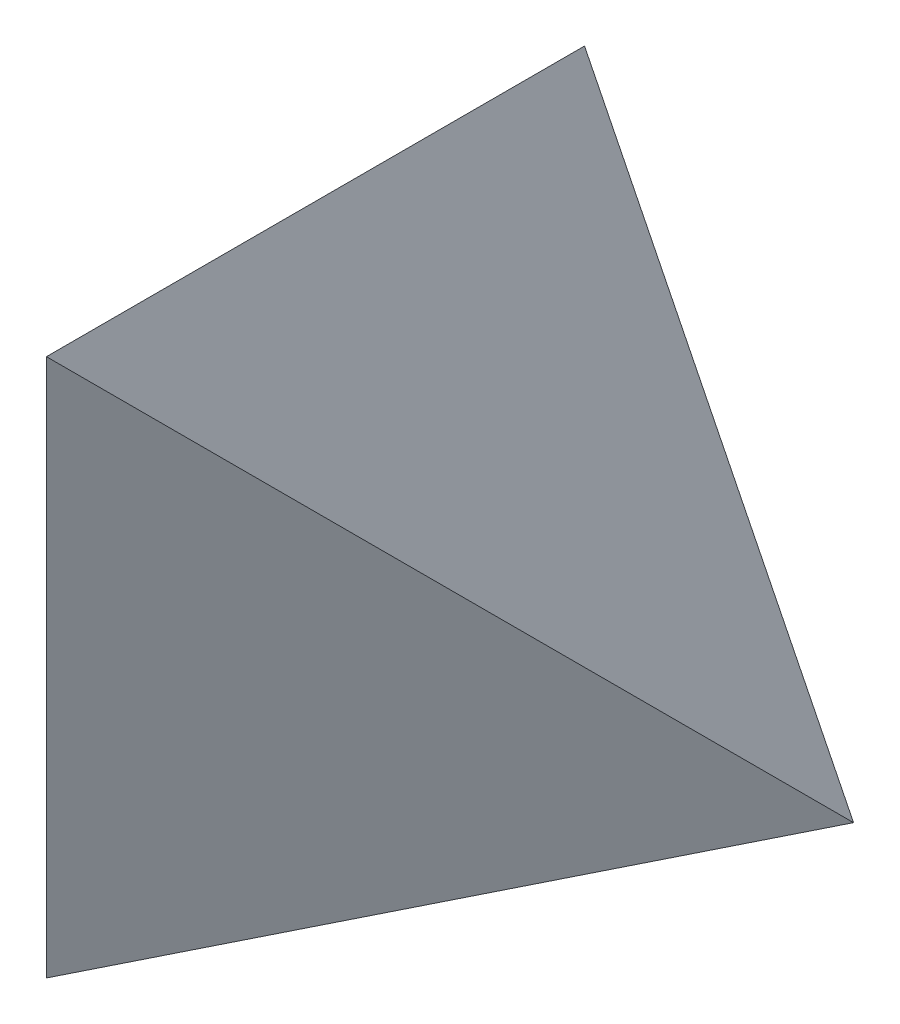
ISO-10303-21;
HEADER;
FILE_DESCRIPTION(('STEP AP214'),'2;1');
FILE_NAME('part.step','',(''),(''),'','','');
FILE_SCHEMA(('AUTOMOTIVE_DESIGN { 1 0 10303 214 1 1 1 1 }'));
ENDSEC;
DATA;
#1=APPLICATION_CONTEXT('core data for automotive mechanical design processes');
#2=APPLICATION_PROTOCOL_DEFINITION('international standard','automotive_design',2000,#1);
#3=PRODUCT_CONTEXT('',#1,'mechanical');
#4=PRODUCT('Part','Part','',(#3));
#5=PRODUCT_RELATED_PRODUCT_CATEGORY('part','',(#4));
#6=PRODUCT_DEFINITION_FORMATION('','',#4);
#7=PRODUCT_DEFINITION_CONTEXT('part definition',#1,'design');
#8=PRODUCT_DEFINITION('design','',#6,#7);
#9=PRODUCT_DEFINITION_SHAPE('','',#8);
#10=(LENGTH_UNIT() NAMED_UNIT(*) SI_UNIT(.MILLI.,.METRE.));
#11=(NAMED_UNIT(*) PLANE_ANGLE_UNIT() SI_UNIT($,.RADIAN.));
#12=(NAMED_UNIT(*) SI_UNIT($,.STERADIAN.) SOLID_ANGLE_UNIT());
#13=UNCERTAINTY_MEASURE_WITH_UNIT(LENGTH_MEASURE(1.E-05),#10,'distance_accuracy_value','');
#14=(GEOMETRIC_REPRESENTATION_CONTEXT(3) GLOBAL_UNCERTAINTY_ASSIGNED_CONTEXT((#13)) GLOBAL_UNIT_ASSIGNED_CONTEXT((#10,
#11,#12)) REPRESENTATION_CONTEXT('',''));
#15=CARTESIAN_POINT('',(0.,0.,0.));
#16=DIRECTION('',(0.,0.,1.));
#17=DIRECTION('',(1.,0.,0.));
#18=AXIS2_PLACEMENT_3D('',#15,#16,#17);
#19=CARTESIAN_POINT('',(40.,0.,40.));
#20=DIRECTION('',(0.,1.,0.));
#21=DIRECTION('',(0.,0.,1.));
#22=AXIS2_PLACEMENT_3D('',#19,#20,#21);
#23=PLANE('',#22);
#24=DIRECTION('',(1.,0.,0.));
#25=VECTOR('',#24,1.);
#26=CARTESIAN_POINT('',(40.,0.,0.));
#27=LINE('',#26,#25);
#28=CARTESIAN_POINT('',(0.,0.,0.));
#29=VERTEX_POINT('',#28);
#30=CARTESIAN_POINT('',(40.,0.,0.));
#31=VERTEX_POINT('',#30);
#32=EDGE_CURVE('E95',#29,#31,#27,.T.);
#33=ORIENTED_EDGE('',*,*,#32,.T.);
#34=DIRECTION('',(0.447213595499958,0.,-0.894427190999916));
#35=VECTOR('',#34,1.);
#36=CARTESIAN_POINT('',(32.,0.,16.));
#37=LINE('',#36,#35);
#38=CARTESIAN_POINT('',(20.,0.,40.));
#39=VERTEX_POINT('',#38);
#40=EDGE_CURVE('E83',#39,#31,#37,.T.);
#41=ORIENTED_EDGE('',*,*,#40,.F.);
#42=DIRECTION('',(0.447213595499958,0.,0.894427190999916));
#43=VECTOR('',#42,1.);
#44=CARTESIAN_POINT('',(0.,0.,0.));
#45=LINE('',#44,#43);
#46=EDGE_CURVE('E88',#29,#39,#45,.T.);
#47=ORIENTED_EDGE('',*,*,#46,.F.);
#48=EDGE_LOOP('',(#33,#41,#47));
#49=FACE_BOUND('',#48,.T.);
#50=ADVANCED_FACE('F52',(#49),#23,.F.);
#51=CARTESIAN_POINT('',(20.,40.,40.));
#52=DIRECTION('',(-0.894427190999916,-0.447213595499958,0.));
#53=DIRECTION('',(0.447213595499958,-0.894427190999916,0.));
#54=AXIS2_PLACEMENT_3D('',#51,#52,#53);
#55=PLANE('',#54);
#56=DIRECTION('',(0.,0.,-1.));
#57=VECTOR('',#56,1.);
#58=CARTESIAN_POINT('',(20.,40.,40.));
#59=LINE('',#58,#57);
#60=CARTESIAN_POINT('',(20.,40.,40.));
#61=VERTEX_POINT('',#60);
#62=CARTESIAN_POINT('',(20.,40.,0.));
#63=VERTEX_POINT('',#62);
#64=EDGE_CURVE('E12',#61,#63,#59,.T.);
#65=ORIENTED_EDGE('',*,*,#64,.F.);
#66=DIRECTION('',(0.333333333333333,-0.666666666666667,-0.666666666666667));
#67=VECTOR('',#66,1.);
#68=CARTESIAN_POINT('',(20.,40.,40.));
#69=LINE('',#68,#67);
#70=EDGE_CURVE('E73',#61,#31,#69,.T.);
#71=ORIENTED_EDGE('',*,*,#70,.T.);
#72=DIRECTION('',(-0.447213595499958,0.894427190999916,0.));
#73=VECTOR('',#72,1.);
#74=CARTESIAN_POINT('',(20.,40.,0.));
#75=LINE('',#74,#73);
#76=EDGE_CURVE('E66',#31,#63,#75,.T.);
#77=ORIENTED_EDGE('',*,*,#76,.T.);
#78=EDGE_LOOP('',(#65,#71,#77));
#79=FACE_BOUND('',#78,.T.);
#80=ADVANCED_FACE('F115',(#79),#55,.F.);
#81=CARTESIAN_POINT('',(0.,0.,40.));
#82=DIRECTION('',(0.894427190999916,-0.447213595499958,0.));
#83=DIRECTION('',(0.447213595499958,0.894427190999916,0.));
#84=AXIS2_PLACEMENT_3D('',#81,#82,#83);
#85=PLANE('',#84);
#86=DIRECTION('',(-0.447213595499958,-0.894427190999916,0.));
#87=VECTOR('',#86,1.);
#88=CARTESIAN_POINT('',(0.,0.,0.));
#89=LINE('',#88,#87);
#90=EDGE_CURVE('E59',#63,#29,#89,.T.);
#91=ORIENTED_EDGE('',*,*,#90,.T.);
#92=DIRECTION('',(0.333333333333333,0.666666666666667,0.666666666666667));
#93=VECTOR('',#92,1.);
#94=CARTESIAN_POINT('',(8.88888888888889,17.7777777777778,17.7777777777778));
#95=LINE('',#94,#93);
#96=EDGE_CURVE('E87',#29,#61,#95,.T.);
#97=ORIENTED_EDGE('',*,*,#96,.T.);
#98=ORIENTED_EDGE('',*,*,#64,.T.);
#99=EDGE_LOOP('',(#91,#97,#98));
#100=FACE_BOUND('',#99,.T.);
#101=ADVANCED_FACE('F105',(#100),#85,.F.);
#102=CARTESIAN_POINT('',(0.,0.,0.));
#103=DIRECTION('',(0.,0.,-1.));
#104=DIRECTION('',(-1.,0.,0.));
#105=AXIS2_PLACEMENT_3D('',#102,#103,#104);
#106=PLANE('',#105);
#107=ORIENTED_EDGE('',*,*,#32,.F.);
#108=ORIENTED_EDGE('',*,*,#90,.F.);
#109=ORIENTED_EDGE('',*,*,#76,.F.);
#110=EDGE_LOOP('',(#107,#108,#109));
#111=FACE_BOUND('',#110,.T.);
#112=ADVANCED_FACE('F107',(#111),#106,.T.);
#113=CARTESIAN_POINT('',(0.,40.,0.));
#114=DIRECTION('',(0.894427190999916,0.,-0.447213595499958));
#115=DIRECTION('',(-0.447213595499958,0.,-0.894427190999916));
#116=AXIS2_PLACEMENT_3D('',#113,#114,#115);
#117=PLANE('',#116);
#118=ORIENTED_EDGE('',*,*,#46,.T.);
#119=DIRECTION('',(0.,-1.,0.));
#120=VECTOR('',#119,1.);
#121=CARTESIAN_POINT('',(20.,40.,40.));
#122=LINE('',#121,#120);
#123=EDGE_CURVE('E80',#61,#39,#122,.T.);
#124=ORIENTED_EDGE('',*,*,#123,.F.);
#125=ORIENTED_EDGE('',*,*,#96,.F.);
#126=EDGE_LOOP('',(#118,#124,#125));
#127=FACE_BOUND('',#126,.T.);
#128=ADVANCED_FACE('F97',(#127),#117,.F.);
#129=CARTESIAN_POINT('',(32.,40.,16.));
#130=DIRECTION('',(-0.894427190999916,0.,-0.447213595499958));
#131=DIRECTION('',(-0.447213595499958,0.,0.894427190999916));
#132=AXIS2_PLACEMENT_3D('',#129,#130,#131);
#133=PLANE('',#132);
#134=ORIENTED_EDGE('',*,*,#123,.T.);
#135=ORIENTED_EDGE('',*,*,#40,.T.);
#136=ORIENTED_EDGE('',*,*,#70,.F.);
#137=EDGE_LOOP('',(#134,#135,#136));
#138=FACE_BOUND('',#137,.T.);
#139=ADVANCED_FACE('F82',(#138),#133,.F.);
#140=CLOSED_SHELL('',(#50,#80,#101,#112,#128,#139));
#141=MANIFOLD_SOLID_BREP('B2',#140);
#142=ADVANCED_BREP_SHAPE_REPRESENTATION('',(#18,#141),#14);
#143=SHAPE_DEFINITION_REPRESENTATION(#9,#142);
ENDSEC;
END-ISO-10303-21;
